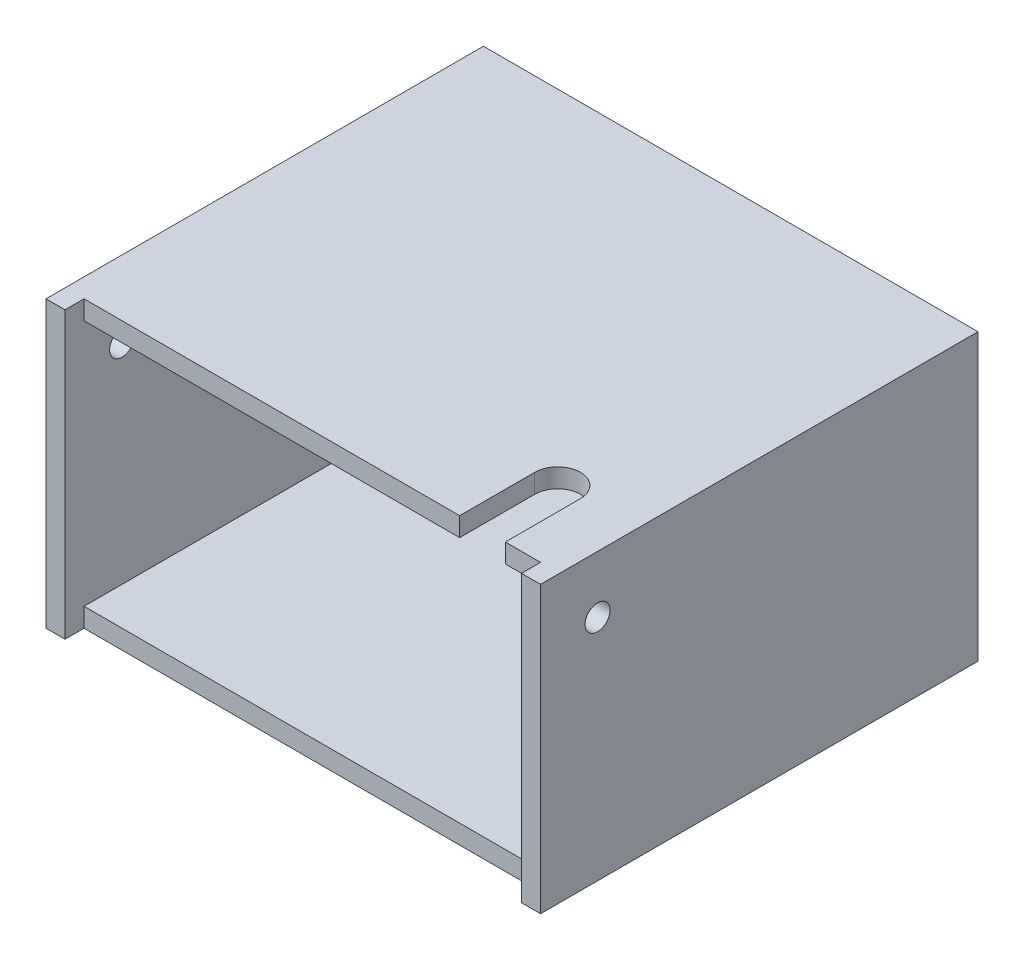
ISO-10303-21;
HEADER;
FILE_DESCRIPTION(('STEP AP214'),'2;1');
FILE_NAME('part.step','',(''),(''),'','','');
FILE_SCHEMA(('AUTOMOTIVE_DESIGN { 1 0 10303 214 1 1 1 1 }'));
ENDSEC;
DATA;
#1=APPLICATION_CONTEXT('core data for automotive mechanical design processes');
#2=APPLICATION_PROTOCOL_DEFINITION('international standard','automotive_design',2000,#1);
#3=PRODUCT_CONTEXT('',#1,'mechanical');
#4=PRODUCT('Part','Part','',(#3));
#5=PRODUCT_RELATED_PRODUCT_CATEGORY('part','',(#4));
#6=PRODUCT_DEFINITION_FORMATION('','',#4);
#7=PRODUCT_DEFINITION_CONTEXT('part definition',#1,'design');
#8=PRODUCT_DEFINITION('design','',#6,#7);
#9=PRODUCT_DEFINITION_SHAPE('','',#8);
#10=(LENGTH_UNIT() NAMED_UNIT(*) SI_UNIT(.MILLI.,.METRE.));
#11=(NAMED_UNIT(*) PLANE_ANGLE_UNIT() SI_UNIT($,.RADIAN.));
#12=(NAMED_UNIT(*) SI_UNIT($,.STERADIAN.) SOLID_ANGLE_UNIT());
#13=UNCERTAINTY_MEASURE_WITH_UNIT(LENGTH_MEASURE(1.E-05),#10,'distance_accuracy_value','');
#14=(GEOMETRIC_REPRESENTATION_CONTEXT(3) GLOBAL_UNCERTAINTY_ASSIGNED_CONTEXT((#13)) GLOBAL_UNIT_ASSIGNED_CONTEXT((#10,
#11,#12)) REPRESENTATION_CONTEXT('',''));
#15=CARTESIAN_POINT('',(0.,0.,0.));
#16=DIRECTION('',(0.,0.,1.));
#17=DIRECTION('',(1.,0.,0.));
#18=AXIS2_PLACEMENT_3D('',#15,#16,#17);
#19=CARTESIAN_POINT('',(-38.1,-3.175,31.75));
#20=DIRECTION('',(0.,0.,-1.));
#21=DIRECTION('',(-1.,0.,0.));
#22=AXIS2_PLACEMENT_3D('',#19,#20,#21);
#23=PLANE('',#22);
#24=DIRECTION('',(1.,0.,0.));
#25=VECTOR('',#24,1.);
#26=CARTESIAN_POINT('',(0.,44.45,31.75));
#27=LINE('',#26,#25);
#28=CARTESIAN_POINT('',(32.2199,44.45,31.75));
#29=VERTEX_POINT('',#28);
#30=CARTESIAN_POINT('',(38.1,44.45,31.75));
#31=VERTEX_POINT('',#30);
#32=EDGE_CURVE('E173',#29,#31,#27,.T.);
#33=ORIENTED_EDGE('',*,*,#32,.F.);
#34=DIRECTION('',(0.,1.,0.));
#35=VECTOR('',#34,1.);
#36=CARTESIAN_POINT('',(32.2199,-3.176,31.75));
#37=LINE('',#36,#35);
#38=CARTESIAN_POINT('',(32.2199,41.275,31.75));
#39=VERTEX_POINT('',#38);
#40=EDGE_CURVE('E168',#39,#29,#37,.T.);
#41=ORIENTED_EDGE('',*,*,#40,.F.);
#42=DIRECTION('',(1.,0.,0.));
#43=VECTOR('',#42,1.);
#44=CARTESIAN_POINT('',(0.,41.275,31.75));
#45=LINE('',#44,#43);
#46=CARTESIAN_POINT('',(38.1,41.275,31.75));
#47=VERTEX_POINT('',#46);
#48=EDGE_CURVE('E60',#39,#47,#45,.T.);
#49=ORIENTED_EDGE('',*,*,#48,.T.);
#50=DIRECTION('',(0.,1.,0.));
#51=VECTOR('',#50,1.);
#52=CARTESIAN_POINT('',(38.1,-3.175,31.75));
#53=LINE('',#52,#51);
#54=EDGE_CURVE('E278',#47,#31,#53,.T.);
#55=ORIENTED_EDGE('',*,*,#54,.T.);
#56=EDGE_LOOP('',(#33,#41,#49,#55));
#57=FACE_BOUND('',#56,.T.);
#58=ADVANCED_FACE('F36',(#57),#23,.F.);
#59=CARTESIAN_POINT('',(-38.1,41.275,34.925));
#60=DIRECTION('',(0.,0.,-1.));
#61=DIRECTION('',(-1.,0.,0.));
#62=AXIS2_PLACEMENT_3D('',#59,#60,#61);
#63=PLANE('',#62);
#64=DIRECTION('',(1.,0.,0.));
#65=VECTOR('',#64,1.);
#66=CARTESIAN_POINT('',(0.,-3.175,34.925));
#67=LINE('',#66,#65);
#68=CARTESIAN_POINT('',(-41.275,-3.175,34.925));
#69=VERTEX_POINT('',#68);
#70=CARTESIAN_POINT('',(-38.1,-3.175,34.925));
#71=VERTEX_POINT('',#70);
#72=EDGE_CURVE('E218',#69,#71,#67,.T.);
#73=ORIENTED_EDGE('',*,*,#72,.T.);
#74=DIRECTION('',(0.,-1.,0.));
#75=VECTOR('',#74,1.);
#76=CARTESIAN_POINT('',(-38.1,41.275,34.925));
#77=LINE('',#76,#75);
#78=CARTESIAN_POINT('',(-38.1,44.45,34.925));
#79=VERTEX_POINT('',#78);
#80=EDGE_CURVE('E199',#79,#71,#77,.T.);
#81=ORIENTED_EDGE('',*,*,#80,.F.);
#82=DIRECTION('',(1.,0.,0.));
#83=VECTOR('',#82,1.);
#84=CARTESIAN_POINT('',(0.,44.45,34.925));
#85=LINE('',#84,#83);
#86=CARTESIAN_POINT('',(-41.275,44.45,34.925));
#87=VERTEX_POINT('',#86);
#88=EDGE_CURVE('E233',#87,#79,#85,.T.);
#89=ORIENTED_EDGE('',*,*,#88,.F.);
#90=DIRECTION('',(0.,-1.,0.));
#91=VECTOR('',#90,1.);
#92=CARTESIAN_POINT('',(-41.275,41.275,34.925));
#93=LINE('',#92,#91);
#94=EDGE_CURVE('E223',#87,#69,#93,.T.);
#95=ORIENTED_EDGE('',*,*,#94,.T.);
#96=EDGE_LOOP('',(#73,#81,#89,#95));
#97=FACE_BOUND('',#96,.T.);
#98=ADVANCED_FACE('F324',(#97),#63,.F.);
#99=CARTESIAN_POINT('',(38.1,44.45,34.925));
#100=VERTEX_POINT('',#99);
#101=CARTESIAN_POINT('',(41.275,44.45,34.925));
#102=VERTEX_POINT('',#101);
#103=EDGE_CURVE('E229',#100,#102,#85,.T.);
#104=ORIENTED_EDGE('',*,*,#103,.F.);
#105=DIRECTION('',(0.,-1.,0.));
#106=VECTOR('',#105,1.);
#107=CARTESIAN_POINT('',(38.1,41.275,34.925));
#108=LINE('',#107,#106);
#109=CARTESIAN_POINT('',(38.1,-3.175,34.925));
#110=VERTEX_POINT('',#109);
#111=EDGE_CURVE('E192',#100,#110,#108,.T.);
#112=ORIENTED_EDGE('',*,*,#111,.T.);
#113=CARTESIAN_POINT('',(41.275,-3.175,34.925));
#114=VERTEX_POINT('',#113);
#115=EDGE_CURVE('E227',#110,#114,#67,.T.);
#116=ORIENTED_EDGE('',*,*,#115,.T.);
#117=DIRECTION('',(0.,-1.,0.));
#118=VECTOR('',#117,1.);
#119=CARTESIAN_POINT('',(41.275,41.275,34.925));
#120=LINE('',#119,#118);
#121=EDGE_CURVE('E230',#102,#114,#120,.T.);
#122=ORIENTED_EDGE('',*,*,#121,.F.);
#123=EDGE_LOOP('',(#104,#112,#116,#122));
#124=FACE_BOUND('',#123,.T.);
#125=ADVANCED_FACE('F245',(#124),#63,.F.);
#126=CARTESIAN_POINT('',(41.275,41.275,34.925));
#127=DIRECTION('',(-1.,0.,0.));
#128=DIRECTION('',(0.,0.,1.));
#129=AXIS2_PLACEMENT_3D('',#126,#127,#128);
#130=PLANE('',#129);
#131=CARTESIAN_POINT('',(41.275,34.925,25.4));
#132=DIRECTION('',(-1.,0.,0.));
#133=DIRECTION('',(0.,0.,1.));
#134=AXIS2_PLACEMENT_3D('',#131,#132,#133);
#135=CIRCLE('',#134,2.0828);
#136=CARTESIAN_POINT('',(41.275,34.925,27.4828));
#137=VERTEX_POINT('',#136);
#138=EDGE_CURVE('E309',#137,#137,#135,.T.);
#139=ORIENTED_EDGE('',*,*,#138,.T.);
#140=EDGE_LOOP('',(#139));
#141=FACE_BOUND('',#140,.T.);
#142=DIRECTION('',(0.,0.,-1.));
#143=VECTOR('',#142,1.);
#144=CARTESIAN_POINT('',(41.275,-3.175,0.));
#145=LINE('',#144,#143);
#146=CARTESIAN_POINT('',(41.275,-3.175,-38.1));
#147=VERTEX_POINT('',#146);
#148=EDGE_CURVE('E207',#114,#147,#145,.T.);
#149=ORIENTED_EDGE('',*,*,#148,.T.);
#150=DIRECTION('',(0.,-1.,0.));
#151=VECTOR('',#150,1.);
#152=CARTESIAN_POINT('',(41.275,41.275,-38.1));
#153=LINE('',#152,#151);
#154=CARTESIAN_POINT('',(41.275,44.45,-38.1));
#155=VERTEX_POINT('',#154);
#156=EDGE_CURVE('E45',#155,#147,#153,.T.);
#157=ORIENTED_EDGE('',*,*,#156,.F.);
#158=DIRECTION('',(0.,0.,-1.));
#159=VECTOR('',#158,1.);
#160=CARTESIAN_POINT('',(41.275,44.45,0.));
#161=LINE('',#160,#159);
#162=EDGE_CURVE('E214',#102,#155,#161,.T.);
#163=ORIENTED_EDGE('',*,*,#162,.F.);
#164=ORIENTED_EDGE('',*,*,#121,.T.);
#165=EDGE_LOOP('',(#149,#157,#163,#164));
#166=FACE_BOUND('',#165,.T.);
#167=ADVANCED_FACE('F252',(#141,#166),#130,.F.);
#168=CARTESIAN_POINT('',(-38.1,41.275,-38.1));
#169=DIRECTION('',(0.,0.,1.));
#170=DIRECTION('',(1.,0.,0.));
#171=AXIS2_PLACEMENT_3D('',#168,#169,#170);
#172=PLANE('',#171);
#173=CARTESIAN_POINT('',(0.,9.525,-38.1));
#174=DIRECTION('',(0.,0.,1.));
#175=DIRECTION('',(1.,0.,0.));
#176=AXIS2_PLACEMENT_3D('',#173,#174,#175);
#177=CIRCLE('',#176,2.0828);
#178=CARTESIAN_POINT('',(2.0828,9.525,-38.1));
#179=VERTEX_POINT('',#178);
#180=EDGE_CURVE('E294',#179,#179,#177,.T.);
#181=ORIENTED_EDGE('',*,*,#180,.T.);
#182=EDGE_LOOP('',(#181));
#183=FACE_BOUND('',#182,.T.);
#184=DIRECTION('',(-1.,0.,0.));
#185=VECTOR('',#184,1.);
#186=CARTESIAN_POINT('',(0.,-3.175,-38.1));
#187=LINE('',#186,#185);
#188=CARTESIAN_POINT('',(-41.275,-3.175,-38.1));
#189=VERTEX_POINT('',#188);
#190=EDGE_CURVE('E210',#147,#189,#187,.T.);
#191=ORIENTED_EDGE('',*,*,#190,.T.);
#192=DIRECTION('',(0.,-1.,0.));
#193=VECTOR('',#192,1.);
#194=CARTESIAN_POINT('',(-41.275,41.275,-38.1));
#195=LINE('',#194,#193);
#196=CARTESIAN_POINT('',(-41.275,44.45,-38.1));
#197=VERTEX_POINT('',#196);
#198=EDGE_CURVE('E213',#197,#189,#195,.T.);
#199=ORIENTED_EDGE('',*,*,#198,.F.);
#200=DIRECTION('',(-1.,0.,0.));
#201=VECTOR('',#200,1.);
#202=CARTESIAN_POINT('',(0.,44.45,-38.1));
#203=LINE('',#202,#201);
#204=EDGE_CURVE('E217',#155,#197,#203,.T.);
#205=ORIENTED_EDGE('',*,*,#204,.F.);
#206=ORIENTED_EDGE('',*,*,#156,.T.);
#207=EDGE_LOOP('',(#191,#199,#205,#206));
#208=FACE_BOUND('',#207,.T.);
#209=ADVANCED_FACE('F258',(#183,#208),#172,.F.);
#210=CARTESIAN_POINT('',(-41.275,41.275,34.925));
#211=DIRECTION('',(1.,0.,0.));
#212=DIRECTION('',(0.,0.,-1.));
#213=AXIS2_PLACEMENT_3D('',#210,#211,#212);
#214=PLANE('',#213);
#215=CARTESIAN_POINT('',(-41.275,34.925,25.4));
#216=DIRECTION('',(-1.,0.,0.));
#217=DIRECTION('',(0.,0.,1.));
#218=AXIS2_PLACEMENT_3D('',#215,#216,#217);
#219=CIRCLE('',#218,2.0828);
#220=CARTESIAN_POINT('',(-41.275,34.925,27.4828));
#221=VERTEX_POINT('',#220);
#222=EDGE_CURVE('E312',#221,#221,#219,.T.);
#223=ORIENTED_EDGE('',*,*,#222,.F.);
#224=EDGE_LOOP('',(#223));
#225=FACE_BOUND('',#224,.T.);
#226=DIRECTION('',(0.,0.,1.));
#227=VECTOR('',#226,1.);
#228=CARTESIAN_POINT('',(-41.275,-3.175,0.));
#229=LINE('',#228,#227);
#230=EDGE_CURVE('E220',#189,#69,#229,.T.);
#231=ORIENTED_EDGE('',*,*,#230,.T.);
#232=ORIENTED_EDGE('',*,*,#94,.F.);
#233=DIRECTION('',(0.,0.,1.));
#234=VECTOR('',#233,1.);
#235=CARTESIAN_POINT('',(-41.275,44.45,0.));
#236=LINE('',#235,#234);
#237=EDGE_CURVE('E225',#197,#87,#236,.T.);
#238=ORIENTED_EDGE('',*,*,#237,.F.);
#239=ORIENTED_EDGE('',*,*,#198,.T.);
#240=EDGE_LOOP('',(#231,#232,#238,#239));
#241=FACE_BOUND('',#240,.T.);
#242=ADVANCED_FACE('F318',(#225,#241),#214,.F.);
#243=CARTESIAN_POINT('',(0.,44.45,0.));
#244=DIRECTION('',(0.,-1.,0.));
#245=DIRECTION('',(0.,0.,-1.));
#246=AXIS2_PLACEMENT_3D('',#243,#244,#245);
#247=PLANE('',#246);
#248=CARTESIAN_POINT('',(28.4099,44.45,19.2151));
#249=DIRECTION('',(0.,1.,0.));
#250=DIRECTION('',(0.,0.,1.));
#251=AXIS2_PLACEMENT_3D('',#248,#249,#250);
#252=CIRCLE('',#251,3.81);
#253=CARTESIAN_POINT('',(32.2199,44.45,19.2151));
#254=VERTEX_POINT('',#253);
#255=CARTESIAN_POINT('',(24.5999,44.45,19.2151));
#256=VERTEX_POINT('',#255);
#257=EDGE_CURVE('E157',#254,#256,#252,.T.);
#258=ORIENTED_EDGE('',*,*,#257,.F.);
#259=DIRECTION('',(0.,0.,-1.));
#260=VECTOR('',#259,1.);
#261=CARTESIAN_POINT('',(32.2199,44.45,19.2151));
#262=LINE('',#261,#260);
#263=EDGE_CURVE('E284',#29,#254,#262,.T.);
#264=ORIENTED_EDGE('',*,*,#263,.F.);
#265=ORIENTED_EDGE('',*,*,#32,.T.);
#266=DIRECTION('',(0.,0.,1.));
#267=VECTOR('',#266,1.);
#268=CARTESIAN_POINT('',(38.1,44.45,0.));
#269=LINE('',#268,#267);
#270=EDGE_CURVE('E177',#31,#100,#269,.T.);
#271=ORIENTED_EDGE('',*,*,#270,.T.);
#272=ORIENTED_EDGE('',*,*,#103,.T.);
#273=ORIENTED_EDGE('',*,*,#162,.T.);
#274=ORIENTED_EDGE('',*,*,#204,.T.);
#275=ORIENTED_EDGE('',*,*,#237,.T.);
#276=ORIENTED_EDGE('',*,*,#88,.T.);
#277=DIRECTION('',(0.,0.,-1.));
#278=VECTOR('',#277,1.);
#279=CARTESIAN_POINT('',(-38.1000000000001,44.45,0.));
#280=LINE('',#279,#278);
#281=CARTESIAN_POINT('',(-38.1,44.45,31.75));
#282=VERTEX_POINT('',#281);
#283=EDGE_CURVE('E181',#79,#282,#280,.T.);
#284=ORIENTED_EDGE('',*,*,#283,.T.);
#285=CARTESIAN_POINT('',(24.5999,44.45,31.75));
#286=VERTEX_POINT('',#285);
#287=EDGE_CURVE('E175',#282,#286,#27,.T.);
#288=ORIENTED_EDGE('',*,*,#287,.T.);
#289=DIRECTION('',(0.,0.,1.));
#290=VECTOR('',#289,1.);
#291=CARTESIAN_POINT('',(24.5999,44.45,19.2151));
#292=LINE('',#291,#290);
#293=EDGE_CURVE('E52',#256,#286,#292,.T.);
#294=ORIENTED_EDGE('',*,*,#293,.F.);
#295=EDGE_LOOP('',(#258,#264,#265,#271,#272,#273,#274,#275,#276,#284,#288,#294));
#296=FACE_BOUND('',#295,.T.);
#297=ADVANCED_FACE('F262',(#296),#247,.F.);
#298=CARTESIAN_POINT('',(0.,-3.175,0.));
#299=DIRECTION('',(0.,-1.,0.));
#300=DIRECTION('',(0.,0.,-1.));
#301=AXIS2_PLACEMENT_3D('',#298,#299,#300);
#302=PLANE('',#301);
#303=DIRECTION('',(0.,0.,1.));
#304=VECTOR('',#303,1.);
#305=CARTESIAN_POINT('',(-38.1,-3.175,34.925));
#306=LINE('',#305,#304);
#307=CARTESIAN_POINT('',(-38.1,-3.175,31.75));
#308=VERTEX_POINT('',#307);
#309=EDGE_CURVE('E276',#308,#71,#306,.T.);
#310=ORIENTED_EDGE('',*,*,#309,.T.);
#311=ORIENTED_EDGE('',*,*,#72,.F.);
#312=ORIENTED_EDGE('',*,*,#230,.F.);
#313=ORIENTED_EDGE('',*,*,#190,.F.);
#314=ORIENTED_EDGE('',*,*,#148,.F.);
#315=ORIENTED_EDGE('',*,*,#115,.F.);
#316=DIRECTION('',(0.,0.,-1.));
#317=VECTOR('',#316,1.);
#318=CARTESIAN_POINT('',(38.1,-3.175,31.75));
#319=LINE('',#318,#317);
#320=CARTESIAN_POINT('',(38.1,-3.175,31.75));
#321=VERTEX_POINT('',#320);
#322=EDGE_CURVE('E283',#110,#321,#319,.T.);
#323=ORIENTED_EDGE('',*,*,#322,.T.);
#324=DIRECTION('',(-1.,0.,0.));
#325=VECTOR('',#324,1.);
#326=CARTESIAN_POINT('',(-38.1,-3.175,31.75));
#327=LINE('',#326,#325);
#328=EDGE_CURVE('E281',#321,#308,#327,.T.);
#329=ORIENTED_EDGE('',*,*,#328,.T.);
#330=EDGE_LOOP('',(#310,#311,#312,#313,#314,#315,#323,#329));
#331=FACE_BOUND('',#330,.T.);
#332=ADVANCED_FACE('F38',(#331),#302,.T.);
#333=CARTESIAN_POINT('',(38.1,41.275,34.925));
#334=DIRECTION('',(-1.,0.,0.));
#335=DIRECTION('',(0.,0.,1.));
#336=AXIS2_PLACEMENT_3D('',#333,#334,#335);
#337=PLANE('',#336);
#338=CARTESIAN_POINT('',(38.1,34.925,25.4));
#339=DIRECTION('',(-1.,0.,0.));
#340=DIRECTION('',(0.,0.,1.));
#341=AXIS2_PLACEMENT_3D('',#338,#339,#340);
#342=CIRCLE('',#341,2.0828);
#343=CARTESIAN_POINT('',(38.1,34.925,27.4828));
#344=VERTEX_POINT('',#343);
#345=EDGE_CURVE('E304',#344,#344,#342,.T.);
#346=ORIENTED_EDGE('',*,*,#345,.F.);
#347=EDGE_LOOP('',(#346));
#348=FACE_BOUND('',#347,.T.);
#349=DIRECTION('',(0.,0.,-1.));
#350=VECTOR('',#349,1.);
#351=CARTESIAN_POINT('',(38.1,0.,34.925));
#352=LINE('',#351,#350);
#353=CARTESIAN_POINT('',(38.1,0.,31.75));
#354=VERTEX_POINT('',#353);
#355=CARTESIAN_POINT('',(38.1,0.,-34.925));
#356=VERTEX_POINT('',#355);
#357=EDGE_CURVE('E184',#354,#356,#352,.T.);
#358=ORIENTED_EDGE('',*,*,#357,.F.);
#359=EDGE_CURVE('E274',#321,#354,#53,.T.);
#360=ORIENTED_EDGE('',*,*,#359,.F.);
#361=ORIENTED_EDGE('',*,*,#322,.F.);
#362=ORIENTED_EDGE('',*,*,#111,.F.);
#363=ORIENTED_EDGE('',*,*,#270,.F.);
#364=ORIENTED_EDGE('',*,*,#54,.F.);
#365=DIRECTION('',(0.,0.,-1.));
#366=VECTOR('',#365,1.);
#367=CARTESIAN_POINT('',(38.1,41.275,34.925));
#368=LINE('',#367,#366);
#369=CARTESIAN_POINT('',(38.1,41.275,-34.925));
#370=VERTEX_POINT('',#369);
#371=EDGE_CURVE('E185',#47,#370,#368,.T.);
#372=ORIENTED_EDGE('',*,*,#371,.T.);
#373=DIRECTION('',(0.,-1.,0.));
#374=VECTOR('',#373,1.);
#375=CARTESIAN_POINT('',(38.1,41.275,-34.925));
#376=LINE('',#375,#374);
#377=EDGE_CURVE('E204',#370,#356,#376,.T.);
#378=ORIENTED_EDGE('',*,*,#377,.T.);
#379=EDGE_LOOP('',(#358,#360,#361,#362,#363,#364,#372,#378));
#380=FACE_BOUND('',#379,.T.);
#381=ADVANCED_FACE('F335',(#348,#380),#337,.T.);
#382=CARTESIAN_POINT('',(-38.1,41.275,-34.925));
#383=DIRECTION('',(0.,0.,1.));
#384=DIRECTION('',(1.,0.,0.));
#385=AXIS2_PLACEMENT_3D('',#382,#383,#384);
#386=PLANE('',#385);
#387=CARTESIAN_POINT('',(0.,9.525,-34.925));
#388=DIRECTION('',(0.,0.,1.));
#389=DIRECTION('',(1.,0.,0.));
#390=AXIS2_PLACEMENT_3D('',#387,#388,#389);
#391=CIRCLE('',#390,2.0828);
#392=CARTESIAN_POINT('',(2.0828,9.525,-34.925));
#393=VERTEX_POINT('',#392);
#394=EDGE_CURVE('E301',#393,#393,#391,.T.);
#395=ORIENTED_EDGE('',*,*,#394,.F.);
#396=EDGE_LOOP('',(#395));
#397=FACE_BOUND('',#396,.T.);
#398=DIRECTION('',(-1.,0.,0.));
#399=VECTOR('',#398,1.);
#400=CARTESIAN_POINT('',(-38.1,0.,-34.925));
#401=LINE('',#400,#399);
#402=CARTESIAN_POINT('',(-38.1,0.,-34.925));
#403=VERTEX_POINT('',#402);
#404=EDGE_CURVE('E194',#356,#403,#401,.T.);
#405=ORIENTED_EDGE('',*,*,#404,.F.);
#406=ORIENTED_EDGE('',*,*,#377,.F.);
#407=DIRECTION('',(-1.,0.,0.));
#408=VECTOR('',#407,1.);
#409=CARTESIAN_POINT('',(-38.1,41.275,-34.925));
#410=LINE('',#409,#408);
#411=CARTESIAN_POINT('',(-38.1,41.275,-34.925));
#412=VERTEX_POINT('',#411);
#413=EDGE_CURVE('E187',#370,#412,#410,.T.);
#414=ORIENTED_EDGE('',*,*,#413,.T.);
#415=DIRECTION('',(0.,-1.,0.));
#416=VECTOR('',#415,1.);
#417=CARTESIAN_POINT('',(-38.1,41.275,-34.925));
#418=LINE('',#417,#416);
#419=EDGE_CURVE('E201',#412,#403,#418,.T.);
#420=ORIENTED_EDGE('',*,*,#419,.T.);
#421=EDGE_LOOP('',(#405,#406,#414,#420));
#422=FACE_BOUND('',#421,.T.);
#423=ADVANCED_FACE('F333',(#397,#422),#386,.T.);
#424=CARTESIAN_POINT('',(-38.1,41.275,34.925));
#425=DIRECTION('',(1.,0.,0.));
#426=DIRECTION('',(0.,0.,-1.));
#427=AXIS2_PLACEMENT_3D('',#424,#425,#426);
#428=PLANE('',#427);
#429=CARTESIAN_POINT('',(-38.1,34.925,25.4));
#430=DIRECTION('',(1.,0.,0.));
#431=DIRECTION('',(0.,0.,-1.));
#432=AXIS2_PLACEMENT_3D('',#429,#430,#431);
#433=CIRCLE('',#432,2.0828);
#434=CARTESIAN_POINT('',(-38.1,34.925,23.3172));
#435=VERTEX_POINT('',#434);
#436=EDGE_CURVE('E40',#435,#435,#433,.T.);
#437=ORIENTED_EDGE('',*,*,#436,.F.);
#438=EDGE_LOOP('',(#437));
#439=FACE_BOUND('',#438,.T.);
#440=DIRECTION('',(0.,0.,1.));
#441=VECTOR('',#440,1.);
#442=CARTESIAN_POINT('',(-38.1,41.275,34.925));
#443=LINE('',#442,#441);
#444=CARTESIAN_POINT('',(-38.1,41.275,31.75));
#445=VERTEX_POINT('',#444);
#446=EDGE_CURVE('E190',#412,#445,#443,.T.);
#447=ORIENTED_EDGE('',*,*,#446,.T.);
#448=DIRECTION('',(0.,1.,0.));
#449=VECTOR('',#448,1.);
#450=CARTESIAN_POINT('',(-38.1,-3.175,31.75));
#451=LINE('',#450,#449);
#452=EDGE_CURVE('E172',#445,#282,#451,.T.);
#453=ORIENTED_EDGE('',*,*,#452,.T.);
#454=ORIENTED_EDGE('',*,*,#283,.F.);
#455=ORIENTED_EDGE('',*,*,#80,.T.);
#456=ORIENTED_EDGE('',*,*,#309,.F.);
#457=CARTESIAN_POINT('',(-38.1,0.,31.75));
#458=VERTEX_POINT('',#457);
#459=EDGE_CURVE('E268',#308,#458,#451,.T.);
#460=ORIENTED_EDGE('',*,*,#459,.T.);
#461=DIRECTION('',(0.,0.,1.));
#462=VECTOR('',#461,1.);
#463=CARTESIAN_POINT('',(-38.1,0.,34.925));
#464=LINE('',#463,#462);
#465=EDGE_CURVE('E188',#403,#458,#464,.T.);
#466=ORIENTED_EDGE('',*,*,#465,.F.);
#467=ORIENTED_EDGE('',*,*,#419,.F.);
#468=EDGE_LOOP('',(#447,#453,#454,#455,#456,#460,#466,#467));
#469=FACE_BOUND('',#468,.T.);
#470=ADVANCED_FACE('F326',(#439,#469),#428,.T.);
#471=CARTESIAN_POINT('',(0.,41.275,0.));
#472=DIRECTION('',(0.,-1.,0.));
#473=DIRECTION('',(0.,0.,-1.));
#474=AXIS2_PLACEMENT_3D('',#471,#472,#473);
#475=PLANE('',#474);
#476=DIRECTION('',(0.,0.,-1.));
#477=VECTOR('',#476,1.);
#478=CARTESIAN_POINT('',(32.2199,41.275,19.2151));
#479=LINE('',#478,#477);
#480=CARTESIAN_POINT('',(32.2199,41.275,19.2151));
#481=VERTEX_POINT('',#480);
#482=EDGE_CURVE('E288',#39,#481,#479,.T.);
#483=ORIENTED_EDGE('',*,*,#482,.T.);
#484=CARTESIAN_POINT('',(28.4099,41.275,19.2151));
#485=DIRECTION('',(0.,-1.,0.));
#486=DIRECTION('',(0.,0.,-1.));
#487=AXIS2_PLACEMENT_3D('',#484,#485,#486);
#488=CIRCLE('',#487,3.81);
#489=CARTESIAN_POINT('',(24.5999,41.275,19.2151));
#490=VERTEX_POINT('',#489);
#491=EDGE_CURVE('E167',#481,#490,#488,.F.);
#492=ORIENTED_EDGE('',*,*,#491,.T.);
#493=DIRECTION('',(0.,0.,1.));
#494=VECTOR('',#493,1.);
#495=CARTESIAN_POINT('',(24.5999,41.275,19.2151));
#496=LINE('',#495,#494);
#497=CARTESIAN_POINT('',(24.5999,41.275,31.75));
#498=VERTEX_POINT('',#497);
#499=EDGE_CURVE('E152',#490,#498,#496,.T.);
#500=ORIENTED_EDGE('',*,*,#499,.T.);
#501=EDGE_CURVE('E165',#445,#498,#45,.T.);
#502=ORIENTED_EDGE('',*,*,#501,.F.);
#503=ORIENTED_EDGE('',*,*,#446,.F.);
#504=ORIENTED_EDGE('',*,*,#413,.F.);
#505=ORIENTED_EDGE('',*,*,#371,.F.);
#506=ORIENTED_EDGE('',*,*,#48,.F.);
#507=EDGE_LOOP('',(#483,#492,#500,#502,#503,#504,#505,#506));
#508=FACE_BOUND('',#507,.T.);
#509=ADVANCED_FACE('F163',(#508),#475,.T.);
#510=CARTESIAN_POINT('',(0.,0.,0.));
#511=DIRECTION('',(0.,-1.,0.));
#512=DIRECTION('',(0.,0.,-1.));
#513=AXIS2_PLACEMENT_3D('',#510,#511,#512);
#514=PLANE('',#513);
#515=ORIENTED_EDGE('',*,*,#465,.T.);
#516=DIRECTION('',(1.,0.,0.));
#517=VECTOR('',#516,1.);
#518=CARTESIAN_POINT('',(0.,0.,31.75));
#519=LINE('',#518,#517);
#520=EDGE_CURVE('E11',#458,#354,#519,.T.);
#521=ORIENTED_EDGE('',*,*,#520,.T.);
#522=ORIENTED_EDGE('',*,*,#357,.T.);
#523=ORIENTED_EDGE('',*,*,#404,.T.);
#524=EDGE_LOOP('',(#515,#521,#522,#523));
#525=FACE_BOUND('',#524,.T.);
#526=ADVANCED_FACE('F337',(#525),#514,.F.);
#527=ORIENTED_EDGE('',*,*,#459,.F.);
#528=ORIENTED_EDGE('',*,*,#328,.F.);
#529=ORIENTED_EDGE('',*,*,#359,.T.);
#530=ORIENTED_EDGE('',*,*,#520,.F.);
#531=EDGE_LOOP('',(#527,#528,#529,#530));
#532=FACE_BOUND('',#531,.T.);
#533=ADVANCED_FACE('F338',(#532),#23,.F.);
#534=ORIENTED_EDGE('',*,*,#501,.T.);
#535=DIRECTION('',(0.,1.,0.));
#536=VECTOR('',#535,1.);
#537=CARTESIAN_POINT('',(24.5999,-3.176,31.75));
#538=LINE('',#537,#536);
#539=EDGE_CURVE('E149',#498,#286,#538,.T.);
#540=ORIENTED_EDGE('',*,*,#539,.T.);
#541=ORIENTED_EDGE('',*,*,#287,.F.);
#542=ORIENTED_EDGE('',*,*,#452,.F.);
#543=EDGE_LOOP('',(#534,#540,#541,#542));
#544=FACE_BOUND('',#543,.T.);
#545=ADVANCED_FACE('F170',(#544),#23,.F.);
#546=CARTESIAN_POINT('',(28.4099,-3.176,19.2151));
#547=DIRECTION('',(0.,1.,0.));
#548=DIRECTION('',(0.,0.,1.));
#549=AXIS2_PLACEMENT_3D('',#546,#547,#548);
#550=CYLINDRICAL_SURFACE('',#549,3.81);
#551=DIRECTION('',(0.,1.,0.));
#552=VECTOR('',#551,1.);
#553=CARTESIAN_POINT('',(32.2199,-3.176,19.2151));
#554=LINE('',#553,#552);
#555=EDGE_CURVE('E291',#481,#254,#554,.T.);
#556=ORIENTED_EDGE('',*,*,#555,.T.);
#557=ORIENTED_EDGE('',*,*,#257,.T.);
#558=DIRECTION('',(0.,1.,0.));
#559=VECTOR('',#558,1.);
#560=CARTESIAN_POINT('',(24.5999,-3.176,19.2151));
#561=LINE('',#560,#559);
#562=EDGE_CURVE('E287',#490,#256,#561,.T.);
#563=ORIENTED_EDGE('',*,*,#562,.F.);
#564=ORIENTED_EDGE('',*,*,#491,.F.);
#565=EDGE_LOOP('',(#556,#557,#563,#564));
#566=FACE_BOUND('',#565,.T.);
#567=ADVANCED_FACE('F345',(#566),#550,.F.);
#568=CARTESIAN_POINT('',(32.2199,-3.176,19.2151));
#569=DIRECTION('',(1.,0.,0.));
#570=DIRECTION('',(0.,0.,-1.));
#571=AXIS2_PLACEMENT_3D('',#568,#569,#570);
#572=PLANE('',#571);
#573=ORIENTED_EDGE('',*,*,#40,.T.);
#574=ORIENTED_EDGE('',*,*,#263,.T.);
#575=ORIENTED_EDGE('',*,*,#555,.F.);
#576=ORIENTED_EDGE('',*,*,#482,.F.);
#577=EDGE_LOOP('',(#573,#574,#575,#576));
#578=FACE_BOUND('',#577,.T.);
#579=ADVANCED_FACE('F356',(#578),#572,.F.);
#580=CARTESIAN_POINT('',(24.5999,-3.176,19.2151));
#581=DIRECTION('',(-1.,0.,0.));
#582=DIRECTION('',(0.,0.,1.));
#583=AXIS2_PLACEMENT_3D('',#580,#581,#582);
#584=PLANE('',#583);
#585=ORIENTED_EDGE('',*,*,#562,.T.);
#586=ORIENTED_EDGE('',*,*,#293,.T.);
#587=ORIENTED_EDGE('',*,*,#539,.F.);
#588=ORIENTED_EDGE('',*,*,#499,.F.);
#589=EDGE_LOOP('',(#585,#586,#587,#588));
#590=FACE_BOUND('',#589,.T.);
#591=ADVANCED_FACE('F151',(#590),#584,.F.);
#592=CARTESIAN_POINT('',(0.,9.525,-38.1));
#593=DIRECTION('',(0.,0.,1.));
#594=DIRECTION('',(1.,0.,0.));
#595=AXIS2_PLACEMENT_3D('',#592,#593,#594);
#596=CYLINDRICAL_SURFACE('',#595,2.0828);
#597=ORIENTED_EDGE('',*,*,#180,.F.);
#598=EDGE_LOOP('',(#597));
#599=FACE_BOUND('',#598,.T.);
#600=ORIENTED_EDGE('',*,*,#394,.T.);
#601=EDGE_LOOP('',(#600));
#602=FACE_BOUND('',#601,.T.);
#603=ADVANCED_FACE('F366',(#599,#602),#596,.F.);
#604=CARTESIAN_POINT('',(41.275,34.925,25.4));
#605=DIRECTION('',(-1.,0.,0.));
#606=DIRECTION('',(0.,0.,1.));
#607=AXIS2_PLACEMENT_3D('',#604,#605,#606);
#608=CYLINDRICAL_SURFACE('',#607,2.0828);
#609=ORIENTED_EDGE('',*,*,#436,.T.);
#610=EDGE_LOOP('',(#609));
#611=FACE_BOUND('',#610,.T.);
#612=ORIENTED_EDGE('',*,*,#222,.T.);
#613=EDGE_LOOP('',(#612));
#614=FACE_BOUND('',#613,.T.);
#615=ADVANCED_FACE('F316',(#611,#614),#608,.F.);
#616=ORIENTED_EDGE('',*,*,#345,.T.);
#617=EDGE_LOOP('',(#616));
#618=FACE_BOUND('',#617,.T.);
#619=ORIENTED_EDGE('',*,*,#138,.F.);
#620=EDGE_LOOP('',(#619));
#621=FACE_BOUND('',#620,.T.);
#622=ADVANCED_FACE('F371',(#618,#621),#608,.F.);
#623=CLOSED_SHELL('',(#58,#98,#125,#167,#209,#242,#297,#332,#381,#423,#470,#509,#526,#533,#545,
#567,#579,#591,#603,#615,#622));
#624=MANIFOLD_SOLID_BREP('B2',#623);
#625=ADVANCED_BREP_SHAPE_REPRESENTATION('',(#18,#624),#14);
#626=SHAPE_DEFINITION_REPRESENTATION(#9,#625);
ENDSEC;
END-ISO-10303-21;
